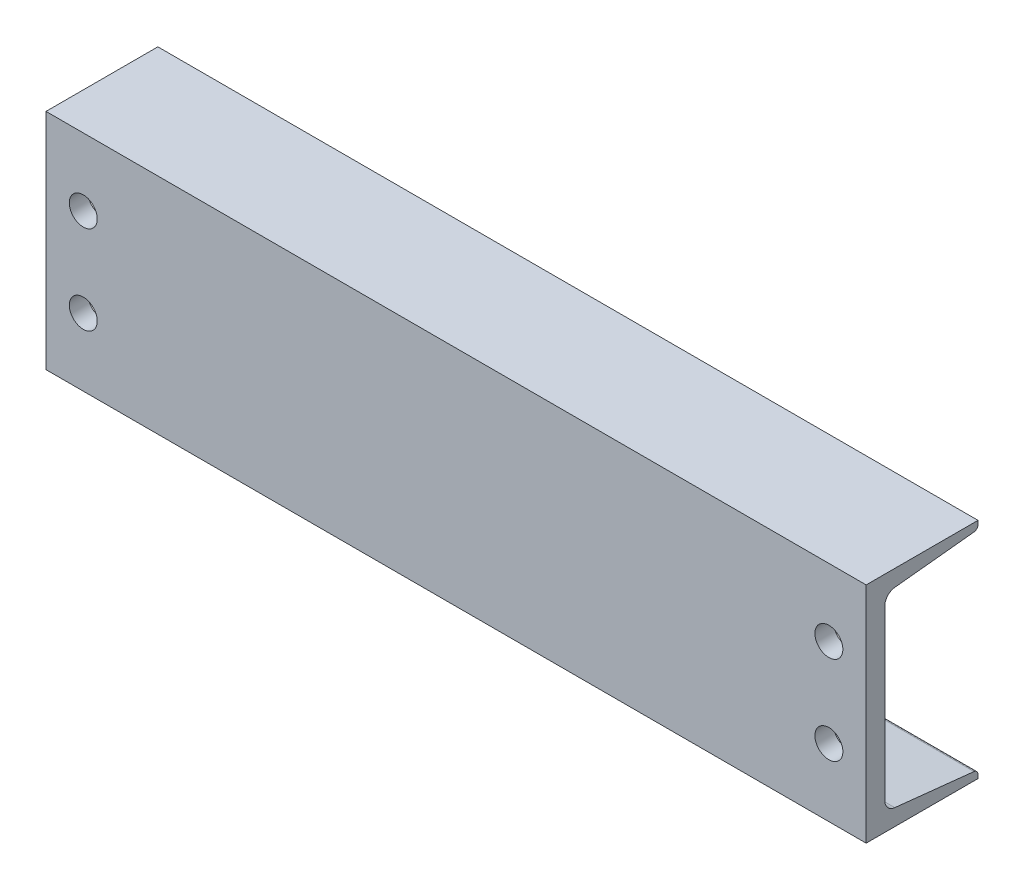
ISO-10303-21;
HEADER;
FILE_DESCRIPTION(('STEP AP214'),'2;1');
FILE_NAME('part.step','',(''),(''),'','','');
FILE_SCHEMA(('AUTOMOTIVE_DESIGN { 1 0 10303 214 1 1 1 1 }'));
ENDSEC;
DATA;
#1=APPLICATION_CONTEXT('core data for automotive mechanical design processes');
#2=APPLICATION_PROTOCOL_DEFINITION('international standard','automotive_design',2000,#1);
#3=PRODUCT_CONTEXT('',#1,'mechanical');
#4=PRODUCT('Part','Part','',(#3));
#5=PRODUCT_RELATED_PRODUCT_CATEGORY('part','',(#4));
#6=PRODUCT_DEFINITION_FORMATION('','',#4);
#7=PRODUCT_DEFINITION_CONTEXT('part definition',#1,'design');
#8=PRODUCT_DEFINITION('design','',#6,#7);
#9=PRODUCT_DEFINITION_SHAPE('','',#8);
#10=(LENGTH_UNIT() NAMED_UNIT(*) SI_UNIT(.MILLI.,.METRE.));
#11=(NAMED_UNIT(*) PLANE_ANGLE_UNIT() SI_UNIT($,.RADIAN.));
#12=(NAMED_UNIT(*) SI_UNIT($,.STERADIAN.) SOLID_ANGLE_UNIT());
#13=UNCERTAINTY_MEASURE_WITH_UNIT(LENGTH_MEASURE(1.E-05),#10,'distance_accuracy_value','');
#14=(GEOMETRIC_REPRESENTATION_CONTEXT(3) GLOBAL_UNCERTAINTY_ASSIGNED_CONTEXT((#13)) GLOBAL_UNIT_ASSIGNED_CONTEXT((#10,
#11,#12)) REPRESENTATION_CONTEXT('',''));
#15=CARTESIAN_POINT('',(0.,0.,0.));
#16=DIRECTION('',(0.,0.,1.));
#17=DIRECTION('',(1.,0.,0.));
#18=AXIS2_PLACEMENT_3D('',#15,#16,#17);
#19=CARTESIAN_POINT('',(279.4,-76.2,48.8061));
#20=DIRECTION('',(0.,1.,0.));
#21=DIRECTION('',(0.,0.,1.));
#22=AXIS2_PLACEMENT_3D('',#19,#20,#21);
#23=PLANE('',#22);
#24=CARTESIAN_POINT('',(165.1,-76.2,10.7061000000001));
#25=DIRECTION('',(0.,-1.,0.));
#26=DIRECTION('',(0.,0.,1.));
#27=AXIS2_PLACEMENT_3D('',#24,#25,#26);
#28=CIRCLE('',#27,9.525);
#29=CARTESIAN_POINT('',(165.1,-76.2,20.2311));
#30=VERTEX_POINT('',#29);
#31=EDGE_CURVE('E266',#30,#30,#28,.T.);
#32=ORIENTED_EDGE('',*,*,#31,.F.);
#33=EDGE_LOOP('',(#32));
#34=FACE_BOUND('',#33,.T.);
#35=CARTESIAN_POINT('',(-165.1,-76.2,10.7061));
#36=DIRECTION('',(0.,-1.,0.));
#37=DIRECTION('',(0.,0.,-1.));
#38=AXIS2_PLACEMENT_3D('',#35,#36,#37);
#39=CIRCLE('',#38,9.525);
#40=CARTESIAN_POINT('',(-165.1,-76.2,1.18110000000001));
#41=VERTEX_POINT('',#40);
#42=EDGE_CURVE('E269',#41,#41,#39,.T.);
#43=ORIENTED_EDGE('',*,*,#42,.F.);
#44=EDGE_LOOP('',(#43));
#45=FACE_BOUND('',#44,.T.);
#46=DIRECTION('',(0.,0.,-1.));
#47=VECTOR('',#46,1.);
#48=CARTESIAN_POINT('',(-279.4,-76.2,48.8061));
#49=LINE('',#48,#47);
#50=CARTESIAN_POINT('',(-279.4,-76.2,48.8061));
#51=VERTEX_POINT('',#50);
#52=CARTESIAN_POINT('',(-279.4,-76.2,-27.3939));
#53=VERTEX_POINT('',#52);
#54=EDGE_CURVE('E154',#51,#53,#49,.T.);
#55=ORIENTED_EDGE('',*,*,#54,.T.);
#56=DIRECTION('',(-1.,0.,0.));
#57=VECTOR('',#56,1.);
#58=CARTESIAN_POINT('',(279.4,-76.2,-27.3939));
#59=LINE('',#58,#57);
#60=CARTESIAN_POINT('',(279.4,-76.2,-27.3939));
#61=VERTEX_POINT('',#60);
#62=EDGE_CURVE('E11',#61,#53,#59,.T.);
#63=ORIENTED_EDGE('',*,*,#62,.F.);
#64=DIRECTION('',(0.,0.,-1.));
#65=VECTOR('',#64,1.);
#66=CARTESIAN_POINT('',(279.4,-76.2,48.8061));
#67=LINE('',#66,#65);
#68=CARTESIAN_POINT('',(279.4,-76.2,48.8061));
#69=VERTEX_POINT('',#68);
#70=EDGE_CURVE('E177',#69,#61,#67,.T.);
#71=ORIENTED_EDGE('',*,*,#70,.F.);
#72=DIRECTION('',(-1.,0.,0.));
#73=VECTOR('',#72,1.);
#74=CARTESIAN_POINT('',(279.4,-76.2,48.8061));
#75=LINE('',#74,#73);
#76=EDGE_CURVE('E150',#69,#51,#75,.T.);
#77=ORIENTED_EDGE('',*,*,#76,.T.);
#78=EDGE_LOOP('',(#55,#63,#71,#77));
#79=FACE_BOUND('',#78,.T.);
#80=ADVANCED_FACE('F34',(#34,#45,#79),#23,.F.);
#81=CARTESIAN_POINT('',(279.4,-76.2,-27.3939));
#82=DIRECTION('',(0.,0.,1.));
#83=DIRECTION('',(1.,0.,0.));
#84=AXIS2_PLACEMENT_3D('',#81,#82,#83);
#85=PLANE('',#84);
#86=DIRECTION('',(0.,1.,0.));
#87=VECTOR('',#86,1.);
#88=CARTESIAN_POINT('',(-279.4,-76.2,-27.3939));
#89=LINE('',#88,#87);
#90=CARTESIAN_POINT('',(-279.4,-73.7107446530364,-27.3939));
#91=VERTEX_POINT('',#90);
#92=EDGE_CURVE('E157',#53,#91,#89,.T.);
#93=ORIENTED_EDGE('',*,*,#92,.T.);
#94=DIRECTION('',(-1.,0.,0.));
#95=VECTOR('',#94,1.);
#96=CARTESIAN_POINT('',(279.4,-73.7107446530364,-27.3939));
#97=LINE('',#96,#95);
#98=CARTESIAN_POINT('',(279.4,-73.7107446530364,-27.3939));
#99=VERTEX_POINT('',#98);
#100=EDGE_CURVE('E42',#99,#91,#97,.T.);
#101=ORIENTED_EDGE('',*,*,#100,.F.);
#102=DIRECTION('',(0.,1.,0.));
#103=VECTOR('',#102,1.);
#104=CARTESIAN_POINT('',(279.4,-76.2,-27.3939));
#105=LINE('',#104,#103);
#106=EDGE_CURVE('E105',#61,#99,#105,.T.);
#107=ORIENTED_EDGE('',*,*,#106,.F.);
#108=ORIENTED_EDGE('',*,*,#62,.T.);
#109=EDGE_LOOP('',(#93,#101,#107,#108));
#110=FACE_BOUND('',#109,.T.);
#111=ADVANCED_FACE('F258',(#110),#85,.F.);
#112=CARTESIAN_POINT('',(279.4,-73.7107446530364,-24.3459));
#113=DIRECTION('',(-1.,0.,0.));
#114=DIRECTION('',(0.,0.,1.));
#115=AXIS2_PLACEMENT_3D('',#112,#113,#114);
#116=CYLINDRICAL_SURFACE('',#115,3.04799999999999);
#117=CARTESIAN_POINT('',(-279.4,-73.7107446530364,-24.3459));
#118=DIRECTION('',(1.,0.,0.));
#119=DIRECTION('',(0.,0.,-1.));
#120=AXIS2_PLACEMENT_3D('',#117,#118,#119);
#121=CIRCLE('',#120,3.04799999999999);
#122=CARTESIAN_POINT('',(-279.4,-70.6796721065635,-24.6666853145304));
#123=VERTEX_POINT('',#122);
#124=EDGE_CURVE('E160',#91,#123,#121,.T.);
#125=ORIENTED_EDGE('',*,*,#124,.T.);
#126=DIRECTION('',(-1.,0.,0.));
#127=VECTOR('',#126,1.);
#128=CARTESIAN_POINT('',(279.4,-70.6796721065635,-24.6666853145304));
#129=LINE('',#128,#127);
#130=CARTESIAN_POINT('',(279.4,-70.6796721065635,-24.6666853145304));
#131=VERTEX_POINT('',#130);
#132=EDGE_CURVE('E196',#131,#123,#129,.T.);
#133=ORIENTED_EDGE('',*,*,#132,.F.);
#134=CARTESIAN_POINT('',(279.4,-73.7107446530364,-24.3459));
#135=DIRECTION('',(1.,0.,0.));
#136=DIRECTION('',(0.,0.,-1.));
#137=AXIS2_PLACEMENT_3D('',#134,#135,#136);
#138=CIRCLE('',#137,3.04799999999999);
#139=EDGE_CURVE('E204',#99,#131,#138,.T.);
#140=ORIENTED_EDGE('',*,*,#139,.F.);
#141=ORIENTED_EDGE('',*,*,#100,.T.);
#142=EDGE_LOOP('',(#125,#133,#140,#141));
#143=FACE_BOUND('',#142,.T.);
#144=ADVANCED_FACE('F202',(#143),#116,.T.);
#145=CARTESIAN_POINT('',(279.4,-64.9695181148763,29.288063286326));
#146=DIRECTION('',(0.,-0.994446373514726,0.105244525764574));
#147=DIRECTION('',(0.,-0.105244525764574,-0.994446373514726));
#148=AXIS2_PLACEMENT_3D('',#145,#146,#147);
#149=PLANE('',#148);
#150=CARTESIAN_POINT('',(165.1,-66.9360896323852,10.7061000000001));
#151=DIRECTION('',(0.,-0.994446373514726,0.105244525764574));
#152=DIRECTION('',(0.,-0.105244525764574,-0.994446373514726));
#153=AXIS2_PLACEMENT_3D('',#150,#151,#152);
#154=ELLIPSE('',#153,9.57819371027044,9.525);
#155=CARTESIAN_POINT('',(165.1,-67.9441420871039,1.18110000000005));
#156=VERTEX_POINT('',#155);
#157=EDGE_CURVE('E272',#156,#156,#154,.F.);
#158=ORIENTED_EDGE('',*,*,#157,.F.);
#159=EDGE_LOOP('',(#158));
#160=FACE_BOUND('',#159,.T.);
#161=CARTESIAN_POINT('',(-165.1,-66.9360896323853,10.7061));
#162=DIRECTION('',(0.,-0.994446373514726,0.105244525764574));
#163=DIRECTION('',(0.,-0.105244525764574,-0.994446373514726));
#164=AXIS2_PLACEMENT_3D('',#161,#162,#163);
#165=ELLIPSE('',#164,9.57819371027044,9.525);
#166=CARTESIAN_POINT('',(-165.1,-67.9441420871039,1.18110000000001));
#167=VERTEX_POINT('',#166);
#168=EDGE_CURVE('E271',#167,#167,#165,.F.);
#169=ORIENTED_EDGE('',*,*,#168,.F.);
#170=EDGE_LOOP('',(#169));
#171=FACE_BOUND('',#170,.T.);
#172=DIRECTION('',(0.,0.105244525764574,0.994446373514726));
#173=VECTOR('',#172,1.);
#174=CARTESIAN_POINT('',(-279.4,-64.9695181148763,29.288063286326));
#175=LINE('',#174,#173);
#176=CARTESIAN_POINT('',(-279.4,-64.9695181148763,29.288063286326));
#177=VERTEX_POINT('',#176);
#178=EDGE_CURVE('E162',#123,#177,#175,.T.);
#179=ORIENTED_EDGE('',*,*,#178,.T.);
#180=DIRECTION('',(-1.,0.,0.));
#181=VECTOR('',#180,1.);
#182=CARTESIAN_POINT('',(279.4,-64.9695181148763,29.288063286326));
#183=LINE('',#182,#181);
#184=CARTESIAN_POINT('',(279.4,-64.9695181148763,29.288063286326));
#185=VERTEX_POINT('',#184);
#186=EDGE_CURVE('E193',#185,#177,#183,.T.);
#187=ORIENTED_EDGE('',*,*,#186,.F.);
#188=DIRECTION('',(0.,0.105244525764574,0.994446373514726));
#189=VECTOR('',#188,1.);
#190=CARTESIAN_POINT('',(279.4,-64.9695181148763,29.288063286326));
#191=LINE('',#190,#189);
#192=EDGE_CURVE('E222',#131,#185,#191,.T.);
#193=ORIENTED_EDGE('',*,*,#192,.F.);
#194=ORIENTED_EDGE('',*,*,#132,.T.);
#195=EDGE_LOOP('',(#179,#187,#193,#194));
#196=FACE_BOUND('',#195,.T.);
#197=ADVANCED_FACE('F213',(#160,#171,#196),#149,.F.);
#198=CARTESIAN_POINT('',(279.4,-57.3918367486941,28.4861));
#199=DIRECTION('',(-1.,0.,0.));
#200=DIRECTION('',(0.,0.,1.));
#201=AXIS2_PLACEMENT_3D('',#198,#199,#200);
#202=CYLINDRICAL_SURFACE('',#201,7.62000000000001);
#203=CARTESIAN_POINT('',(-279.4,-57.3918367486941,28.4861));
#204=DIRECTION('',(-1.,0.,0.));
#205=DIRECTION('',(0.,0.,-1.));
#206=AXIS2_PLACEMENT_3D('',#203,#204,#205);
#207=CIRCLE('',#206,7.62000000000001);
#208=CARTESIAN_POINT('',(-279.4,-57.3918367486941,36.1061));
#209=VERTEX_POINT('',#208);
#210=EDGE_CURVE('E164',#177,#209,#207,.T.);
#211=ORIENTED_EDGE('',*,*,#210,.T.);
#212=DIRECTION('',(-1.,0.,0.));
#213=VECTOR('',#212,1.);
#214=CARTESIAN_POINT('',(279.4,-57.3918367486941,36.1061));
#215=LINE('',#214,#213);
#216=CARTESIAN_POINT('',(279.4,-57.3918367486941,36.1061));
#217=VERTEX_POINT('',#216);
#218=EDGE_CURVE('E190',#217,#209,#215,.T.);
#219=ORIENTED_EDGE('',*,*,#218,.F.);
#220=CARTESIAN_POINT('',(279.4,-57.3918367486941,28.4861));
#221=DIRECTION('',(-1.,0.,0.));
#222=DIRECTION('',(0.,0.,-1.));
#223=AXIS2_PLACEMENT_3D('',#220,#221,#222);
#224=CIRCLE('',#223,7.62000000000001);
#225=EDGE_CURVE('E219',#185,#217,#224,.T.);
#226=ORIENTED_EDGE('',*,*,#225,.F.);
#227=ORIENTED_EDGE('',*,*,#186,.T.);
#228=EDGE_LOOP('',(#211,#219,#226,#227));
#229=FACE_BOUND('',#228,.T.);
#230=ADVANCED_FACE('F217',(#229),#202,.F.);
#231=CARTESIAN_POINT('',(279.4,57.3918367486941,36.1061));
#232=DIRECTION('',(0.,0.,1.));
#233=DIRECTION('',(0.,-1.,0.));
#234=AXIS2_PLACEMENT_3D('',#231,#232,#233);
#235=PLANE('',#234);
#236=CARTESIAN_POINT('',(254.,30.1625000000001,36.1061));
#237=DIRECTION('',(0.,0.,1.));
#238=DIRECTION('',(0.,-1.,0.));
#239=AXIS2_PLACEMENT_3D('',#236,#237,#238);
#240=CIRCLE('',#239,9.52500000000002);
#241=CARTESIAN_POINT('',(254.,20.6375000000001,36.1061));
#242=VERTEX_POINT('',#241);
#243=EDGE_CURVE('E283',#242,#242,#240,.F.);
#244=ORIENTED_EDGE('',*,*,#243,.F.);
#245=EDGE_LOOP('',(#244));
#246=FACE_BOUND('',#245,.T.);
#247=CARTESIAN_POINT('',(254.,-30.1625000000001,36.1061));
#248=DIRECTION('',(0.,0.,1.));
#249=DIRECTION('',(0.,-1.,0.));
#250=AXIS2_PLACEMENT_3D('',#247,#248,#249);
#251=CIRCLE('',#250,9.52500000000002);
#252=CARTESIAN_POINT('',(254.,-39.6875000000001,36.1061));
#253=VERTEX_POINT('',#252);
#254=EDGE_CURVE('E289',#253,#253,#251,.F.);
#255=ORIENTED_EDGE('',*,*,#254,.F.);
#256=EDGE_LOOP('',(#255));
#257=FACE_BOUND('',#256,.T.);
#258=CARTESIAN_POINT('',(-254.,-30.1625,36.1061));
#259=DIRECTION('',(0.,0.,1.));
#260=DIRECTION('',(0.,-1.,0.));
#261=AXIS2_PLACEMENT_3D('',#258,#259,#260);
#262=CIRCLE('',#261,9.52500000000002);
#263=CARTESIAN_POINT('',(-254.,-39.6875,36.1061));
#264=VERTEX_POINT('',#263);
#265=EDGE_CURVE('E295',#264,#264,#262,.F.);
#266=ORIENTED_EDGE('',*,*,#265,.F.);
#267=EDGE_LOOP('',(#266));
#268=FACE_BOUND('',#267,.T.);
#269=CARTESIAN_POINT('',(-254.,30.1625,36.1061));
#270=DIRECTION('',(0.,0.,1.));
#271=DIRECTION('',(0.,-1.,0.));
#272=AXIS2_PLACEMENT_3D('',#269,#270,#271);
#273=CIRCLE('',#272,9.52500000000002);
#274=CARTESIAN_POINT('',(-254.,20.6375,36.1061));
#275=VERTEX_POINT('',#274);
#276=EDGE_CURVE('E158',#275,#275,#273,.F.);
#277=ORIENTED_EDGE('',*,*,#276,.F.);
#278=EDGE_LOOP('',(#277));
#279=FACE_BOUND('',#278,.T.);
#280=DIRECTION('',(0.,1.,0.));
#281=VECTOR('',#280,1.);
#282=CARTESIAN_POINT('',(-279.4,57.3918367486941,36.1061));
#283=LINE('',#282,#281);
#284=CARTESIAN_POINT('',(-279.4,57.3918367486941,36.1061));
#285=VERTEX_POINT('',#284);
#286=EDGE_CURVE('E166',#209,#285,#283,.T.);
#287=ORIENTED_EDGE('',*,*,#286,.T.);
#288=DIRECTION('',(-1.,0.,0.));
#289=VECTOR('',#288,1.);
#290=CARTESIAN_POINT('',(279.4,57.3918367486941,36.1061));
#291=LINE('',#290,#289);
#292=CARTESIAN_POINT('',(279.4,57.3918367486941,36.1061));
#293=VERTEX_POINT('',#292);
#294=EDGE_CURVE('E187',#293,#285,#291,.T.);
#295=ORIENTED_EDGE('',*,*,#294,.F.);
#296=DIRECTION('',(0.,1.,0.));
#297=VECTOR('',#296,1.);
#298=CARTESIAN_POINT('',(279.4,57.3918367486941,36.1061));
#299=LINE('',#298,#297);
#300=EDGE_CURVE('E221',#217,#293,#299,.T.);
#301=ORIENTED_EDGE('',*,*,#300,.F.);
#302=ORIENTED_EDGE('',*,*,#218,.T.);
#303=EDGE_LOOP('',(#287,#295,#301,#302));
#304=FACE_BOUND('',#303,.T.);
#305=ADVANCED_FACE('F308',(#246,#257,#268,#279,#304),#235,.F.);
#306=CARTESIAN_POINT('',(279.4,57.3918367486941,28.4861));
#307=DIRECTION('',(-1.,0.,0.));
#308=DIRECTION('',(0.,0.,1.));
#309=AXIS2_PLACEMENT_3D('',#306,#307,#308);
#310=CYLINDRICAL_SURFACE('',#309,7.62000000000002);
#311=CARTESIAN_POINT('',(-279.4,57.3918367486941,28.4861));
#312=DIRECTION('',(-1.,0.,0.));
#313=DIRECTION('',(0.,0.,1.));
#314=AXIS2_PLACEMENT_3D('',#311,#312,#313);
#315=CIRCLE('',#314,7.62000000000002);
#316=CARTESIAN_POINT('',(-279.4,64.9695181148764,29.2880632863261));
#317=VERTEX_POINT('',#316);
#318=EDGE_CURVE('E168',#285,#317,#315,.T.);
#319=ORIENTED_EDGE('',*,*,#318,.T.);
#320=DIRECTION('',(-1.,0.,0.));
#321=VECTOR('',#320,1.);
#322=CARTESIAN_POINT('',(279.4,64.9695181148764,29.2880632863261));
#323=LINE('',#322,#321);
#324=CARTESIAN_POINT('',(279.4,64.9695181148764,29.2880632863261));
#325=VERTEX_POINT('',#324);
#326=EDGE_CURVE('E184',#325,#317,#323,.T.);
#327=ORIENTED_EDGE('',*,*,#326,.F.);
#328=CARTESIAN_POINT('',(279.4,57.3918367486941,28.4861));
#329=DIRECTION('',(-1.,0.,0.));
#330=DIRECTION('',(0.,0.,1.));
#331=AXIS2_PLACEMENT_3D('',#328,#329,#330);
#332=CIRCLE('',#331,7.62000000000002);
#333=EDGE_CURVE('E224',#293,#325,#332,.T.);
#334=ORIENTED_EDGE('',*,*,#333,.F.);
#335=ORIENTED_EDGE('',*,*,#294,.T.);
#336=EDGE_LOOP('',(#319,#327,#334,#335));
#337=FACE_BOUND('',#336,.T.);
#338=ADVANCED_FACE('F311',(#337),#310,.F.);
#339=CARTESIAN_POINT('',(279.4,64.9695181148764,29.2880632863261));
#340=DIRECTION('',(0.,0.994446373514726,0.105244525764573));
#341=DIRECTION('',(0.,-0.105244525764573,0.994446373514726));
#342=AXIS2_PLACEMENT_3D('',#339,#340,#341);
#343=PLANE('',#342);
#344=DIRECTION('',(0.,0.105244525764573,-0.994446373514726));
#345=VECTOR('',#344,1.);
#346=CARTESIAN_POINT('',(-279.4,64.9695181148764,29.2880632863261));
#347=LINE('',#346,#345);
#348=CARTESIAN_POINT('',(-279.4,70.6796721065635,-24.6666853145304));
#349=VERTEX_POINT('',#348);
#350=EDGE_CURVE('E170',#317,#349,#347,.T.);
#351=ORIENTED_EDGE('',*,*,#350,.T.);
#352=DIRECTION('',(-1.,0.,0.));
#353=VECTOR('',#352,1.);
#354=CARTESIAN_POINT('',(279.4,70.6796721065635,-24.6666853145304));
#355=LINE('',#354,#353);
#356=CARTESIAN_POINT('',(279.4,70.6796721065635,-24.6666853145304));
#357=VERTEX_POINT('',#356);
#358=EDGE_CURVE('E181',#357,#349,#355,.T.);
#359=ORIENTED_EDGE('',*,*,#358,.F.);
#360=DIRECTION('',(0.,0.105244525764573,-0.994446373514726));
#361=VECTOR('',#360,1.);
#362=CARTESIAN_POINT('',(279.4,64.9695181148764,29.2880632863261));
#363=LINE('',#362,#361);
#364=EDGE_CURVE('E230',#325,#357,#363,.T.);
#365=ORIENTED_EDGE('',*,*,#364,.F.);
#366=ORIENTED_EDGE('',*,*,#326,.T.);
#367=EDGE_LOOP('',(#351,#359,#365,#366));
#368=FACE_BOUND('',#367,.T.);
#369=ADVANCED_FACE('F236',(#368),#343,.F.);
#370=CARTESIAN_POINT('',(279.4,73.7107446530364,-24.3459));
#371=DIRECTION('',(-1.,0.,0.));
#372=DIRECTION('',(0.,0.,1.));
#373=AXIS2_PLACEMENT_3D('',#370,#371,#372);
#374=CYLINDRICAL_SURFACE('',#373,3.048);
#375=CARTESIAN_POINT('',(-279.4,73.7107446530364,-24.3459));
#376=DIRECTION('',(1.,0.,0.));
#377=DIRECTION('',(0.,0.,1.));
#378=AXIS2_PLACEMENT_3D('',#375,#376,#377);
#379=CIRCLE('',#378,3.048);
#380=CARTESIAN_POINT('',(-279.4,73.7107446530364,-27.3939));
#381=VERTEX_POINT('',#380);
#382=EDGE_CURVE('E172',#349,#381,#379,.T.);
#383=ORIENTED_EDGE('',*,*,#382,.T.);
#384=DIRECTION('',(-1.,0.,0.));
#385=VECTOR('',#384,1.);
#386=CARTESIAN_POINT('',(279.4,73.7107446530364,-27.3939));
#387=LINE('',#386,#385);
#388=CARTESIAN_POINT('',(279.4,73.7107446530364,-27.3939));
#389=VERTEX_POINT('',#388);
#390=EDGE_CURVE('E145',#389,#381,#387,.T.);
#391=ORIENTED_EDGE('',*,*,#390,.F.);
#392=CARTESIAN_POINT('',(279.4,73.7107446530364,-24.3459));
#393=DIRECTION('',(1.,0.,0.));
#394=DIRECTION('',(0.,0.,1.));
#395=AXIS2_PLACEMENT_3D('',#392,#393,#394);
#396=CIRCLE('',#395,3.048);
#397=EDGE_CURVE('E136',#357,#389,#396,.T.);
#398=ORIENTED_EDGE('',*,*,#397,.F.);
#399=ORIENTED_EDGE('',*,*,#358,.T.);
#400=EDGE_LOOP('',(#383,#391,#398,#399));
#401=FACE_BOUND('',#400,.T.);
#402=ADVANCED_FACE('F240',(#401),#374,.T.);
#403=CARTESIAN_POINT('',(279.4,76.2,-27.3939));
#404=DIRECTION('',(0.,0.,1.));
#405=DIRECTION('',(0.,-1.,0.));
#406=AXIS2_PLACEMENT_3D('',#403,#404,#405);
#407=PLANE('',#406);
#408=DIRECTION('',(0.,1.,0.));
#409=VECTOR('',#408,1.);
#410=CARTESIAN_POINT('',(-279.4,76.2,-27.3939));
#411=LINE('',#410,#409);
#412=CARTESIAN_POINT('',(-279.4,76.2,-27.3939));
#413=VERTEX_POINT('',#412);
#414=EDGE_CURVE('E144',#381,#413,#411,.T.);
#415=ORIENTED_EDGE('',*,*,#414,.T.);
#416=DIRECTION('',(-1.,0.,0.));
#417=VECTOR('',#416,1.);
#418=CARTESIAN_POINT('',(279.4,76.2,-27.3939));
#419=LINE('',#418,#417);
#420=CARTESIAN_POINT('',(279.4,76.2,-27.3939));
#421=VERTEX_POINT('',#420);
#422=EDGE_CURVE('E141',#421,#413,#419,.T.);
#423=ORIENTED_EDGE('',*,*,#422,.F.);
#424=DIRECTION('',(0.,1.,0.));
#425=VECTOR('',#424,1.);
#426=CARTESIAN_POINT('',(279.4,76.2,-27.3939));
#427=LINE('',#426,#425);
#428=EDGE_CURVE('E130',#389,#421,#427,.T.);
#429=ORIENTED_EDGE('',*,*,#428,.F.);
#430=ORIENTED_EDGE('',*,*,#390,.T.);
#431=EDGE_LOOP('',(#415,#423,#429,#430));
#432=FACE_BOUND('',#431,.T.);
#433=ADVANCED_FACE('F142',(#432),#407,.F.);
#434=CARTESIAN_POINT('',(279.4,76.2,48.8061));
#435=DIRECTION('',(0.,-1.,0.));
#436=DIRECTION('',(0.,0.,-1.));
#437=AXIS2_PLACEMENT_3D('',#434,#435,#436);
#438=PLANE('',#437);
#439=DIRECTION('',(0.,0.,1.));
#440=VECTOR('',#439,1.);
#441=CARTESIAN_POINT('',(-279.4,76.2,48.8061));
#442=LINE('',#441,#440);
#443=CARTESIAN_POINT('',(-279.4,76.2,48.8061));
#444=VERTEX_POINT('',#443);
#445=EDGE_CURVE('E91',#413,#444,#442,.T.);
#446=ORIENTED_EDGE('',*,*,#445,.T.);
#447=DIRECTION('',(-1.,0.,0.));
#448=VECTOR('',#447,1.);
#449=CARTESIAN_POINT('',(279.4,76.2,48.8061));
#450=LINE('',#449,#448);
#451=CARTESIAN_POINT('',(279.4,76.2,48.8061));
#452=VERTEX_POINT('',#451);
#453=EDGE_CURVE('E146',#452,#444,#450,.T.);
#454=ORIENTED_EDGE('',*,*,#453,.F.);
#455=DIRECTION('',(0.,0.,1.));
#456=VECTOR('',#455,1.);
#457=CARTESIAN_POINT('',(279.4,76.2,48.8061));
#458=LINE('',#457,#456);
#459=EDGE_CURVE('E134',#421,#452,#458,.T.);
#460=ORIENTED_EDGE('',*,*,#459,.F.);
#461=ORIENTED_EDGE('',*,*,#422,.T.);
#462=EDGE_LOOP('',(#446,#454,#460,#461));
#463=FACE_BOUND('',#462,.T.);
#464=ADVANCED_FACE('F148',(#463),#438,.F.);
#465=CARTESIAN_POINT('',(279.4,-76.2,48.8061));
#466=DIRECTION('',(0.,0.,-1.));
#467=DIRECTION('',(-1.,0.,0.));
#468=AXIS2_PLACEMENT_3D('',#465,#466,#467);
#469=PLANE('',#468);
#470=CARTESIAN_POINT('',(254.,30.1625000000001,48.8061));
#471=DIRECTION('',(0.,0.,1.));
#472=DIRECTION('',(-1.,0.,0.));
#473=AXIS2_PLACEMENT_3D('',#470,#471,#472);
#474=CIRCLE('',#473,9.52500000000002);
#475=CARTESIAN_POINT('',(244.475,30.1625000000001,48.8061));
#476=VERTEX_POINT('',#475);
#477=EDGE_CURVE('E275',#476,#476,#474,.T.);
#478=ORIENTED_EDGE('',*,*,#477,.F.);
#479=EDGE_LOOP('',(#478));
#480=FACE_BOUND('',#479,.T.);
#481=CARTESIAN_POINT('',(254.,-30.1625000000001,48.8061));
#482=DIRECTION('',(0.,0.,1.));
#483=DIRECTION('',(1.,0.,0.));
#484=AXIS2_PLACEMENT_3D('',#481,#482,#483);
#485=CIRCLE('',#484,9.52500000000002);
#486=CARTESIAN_POINT('',(263.525,-30.1625000000001,48.8061));
#487=VERTEX_POINT('',#486);
#488=EDGE_CURVE('E286',#487,#487,#485,.T.);
#489=ORIENTED_EDGE('',*,*,#488,.F.);
#490=EDGE_LOOP('',(#489));
#491=FACE_BOUND('',#490,.T.);
#492=CARTESIAN_POINT('',(-254.,-30.1625,48.8061));
#493=DIRECTION('',(0.,0.,1.));
#494=DIRECTION('',(-1.,0.,0.));
#495=AXIS2_PLACEMENT_3D('',#492,#493,#494);
#496=CIRCLE('',#495,9.52500000000002);
#497=CARTESIAN_POINT('',(-263.525,-30.1625,48.8061));
#498=VERTEX_POINT('',#497);
#499=EDGE_CURVE('E292',#498,#498,#496,.T.);
#500=ORIENTED_EDGE('',*,*,#499,.F.);
#501=EDGE_LOOP('',(#500));
#502=FACE_BOUND('',#501,.T.);
#503=CARTESIAN_POINT('',(-254.,30.1625,48.8061));
#504=DIRECTION('',(0.,0.,1.));
#505=DIRECTION('',(1.,0.,0.));
#506=AXIS2_PLACEMENT_3D('',#503,#504,#505);
#507=CIRCLE('',#506,9.52500000000002);
#508=CARTESIAN_POINT('',(-244.475,30.1625,48.8061));
#509=VERTEX_POINT('',#508);
#510=EDGE_CURVE('E298',#509,#509,#507,.T.);
#511=ORIENTED_EDGE('',*,*,#510,.F.);
#512=EDGE_LOOP('',(#511));
#513=FACE_BOUND('',#512,.T.);
#514=DIRECTION('',(0.,-1.,0.));
#515=VECTOR('',#514,1.);
#516=CARTESIAN_POINT('',(-279.4,-76.2,48.8061));
#517=LINE('',#516,#515);
#518=EDGE_CURVE('E97',#444,#51,#517,.T.);
#519=ORIENTED_EDGE('',*,*,#518,.T.);
#520=ORIENTED_EDGE('',*,*,#76,.F.);
#521=DIRECTION('',(0.,-1.,0.));
#522=VECTOR('',#521,1.);
#523=CARTESIAN_POINT('',(279.4,-76.2,48.8061));
#524=LINE('',#523,#522);
#525=EDGE_CURVE('E50',#452,#69,#524,.T.);
#526=ORIENTED_EDGE('',*,*,#525,.F.);
#527=ORIENTED_EDGE('',*,*,#453,.T.);
#528=EDGE_LOOP('',(#519,#520,#526,#527));
#529=FACE_BOUND('',#528,.T.);
#530=ADVANCED_FACE('F244',(#480,#491,#502,#513,#529),#469,.F.);
#531=CARTESIAN_POINT('',(279.4,-73.7107446530364,-24.3459));
#532=DIRECTION('',(1.,0.,0.));
#533=DIRECTION('',(0.,0.,-1.));
#534=AXIS2_PLACEMENT_3D('',#531,#532,#533);
#535=PLANE('',#534);
#536=ORIENTED_EDGE('',*,*,#70,.T.);
#537=ORIENTED_EDGE('',*,*,#106,.T.);
#538=ORIENTED_EDGE('',*,*,#139,.T.);
#539=ORIENTED_EDGE('',*,*,#192,.T.);
#540=ORIENTED_EDGE('',*,*,#225,.T.);
#541=ORIENTED_EDGE('',*,*,#300,.T.);
#542=ORIENTED_EDGE('',*,*,#333,.T.);
#543=ORIENTED_EDGE('',*,*,#364,.T.);
#544=ORIENTED_EDGE('',*,*,#397,.T.);
#545=ORIENTED_EDGE('',*,*,#428,.T.);
#546=ORIENTED_EDGE('',*,*,#459,.T.);
#547=ORIENTED_EDGE('',*,*,#525,.T.);
#548=EDGE_LOOP('',(#536,#537,#538,#539,#540,#541,#542,#543,#544,#545,#546,#547));
#549=FACE_BOUND('',#548,.T.);
#550=ADVANCED_FACE('F132',(#549),#535,.T.);
#551=CARTESIAN_POINT('',(-279.4,-73.7107446530364,-24.3459));
#552=DIRECTION('',(1.,0.,0.));
#553=DIRECTION('',(0.,0.,-1.));
#554=AXIS2_PLACEMENT_3D('',#551,#552,#553);
#555=PLANE('',#554);
#556=ORIENTED_EDGE('',*,*,#54,.F.);
#557=ORIENTED_EDGE('',*,*,#518,.F.);
#558=ORIENTED_EDGE('',*,*,#445,.F.);
#559=ORIENTED_EDGE('',*,*,#414,.F.);
#560=ORIENTED_EDGE('',*,*,#382,.F.);
#561=ORIENTED_EDGE('',*,*,#350,.F.);
#562=ORIENTED_EDGE('',*,*,#318,.F.);
#563=ORIENTED_EDGE('',*,*,#286,.F.);
#564=ORIENTED_EDGE('',*,*,#210,.F.);
#565=ORIENTED_EDGE('',*,*,#178,.F.);
#566=ORIENTED_EDGE('',*,*,#124,.F.);
#567=ORIENTED_EDGE('',*,*,#92,.F.);
#568=EDGE_LOOP('',(#556,#557,#558,#559,#560,#561,#562,#563,#564,#565,#566,#567));
#569=FACE_BOUND('',#568,.T.);
#570=ADVANCED_FACE('F208',(#569),#555,.F.);
#571=CARTESIAN_POINT('',(-254.,30.1625,-27.3949));
#572=DIRECTION('',(0.,0.,1.));
#573=DIRECTION('',(1.,0.,0.));
#574=AXIS2_PLACEMENT_3D('',#571,#572,#573);
#575=CYLINDRICAL_SURFACE('',#574,9.52500000000002);
#576=ORIENTED_EDGE('',*,*,#510,.T.);
#577=EDGE_LOOP('',(#576));
#578=FACE_BOUND('',#577,.T.);
#579=ORIENTED_EDGE('',*,*,#276,.T.);
#580=EDGE_LOOP('',(#579));
#581=FACE_BOUND('',#580,.T.);
#582=ADVANCED_FACE('F306',(#578,#581),#575,.F.);
#583=CARTESIAN_POINT('',(-254.,-30.1625,-27.3949));
#584=DIRECTION('',(0.,0.,1.));
#585=DIRECTION('',(1.,0.,0.));
#586=AXIS2_PLACEMENT_3D('',#583,#584,#585);
#587=CYLINDRICAL_SURFACE('',#586,9.52500000000002);
#588=ORIENTED_EDGE('',*,*,#499,.T.);
#589=EDGE_LOOP('',(#588));
#590=FACE_BOUND('',#589,.T.);
#591=ORIENTED_EDGE('',*,*,#265,.T.);
#592=EDGE_LOOP('',(#591));
#593=FACE_BOUND('',#592,.T.);
#594=ADVANCED_FACE('F369',(#590,#593),#587,.F.);
#595=CARTESIAN_POINT('',(254.,-30.1625000000001,-27.3949));
#596=DIRECTION('',(0.,0.,1.));
#597=DIRECTION('',(1.,0.,0.));
#598=AXIS2_PLACEMENT_3D('',#595,#596,#597);
#599=CYLINDRICAL_SURFACE('',#598,9.52500000000002);
#600=ORIENTED_EDGE('',*,*,#488,.T.);
#601=EDGE_LOOP('',(#600));
#602=FACE_BOUND('',#601,.T.);
#603=ORIENTED_EDGE('',*,*,#254,.T.);
#604=EDGE_LOOP('',(#603));
#605=FACE_BOUND('',#604,.T.);
#606=ADVANCED_FACE('F379',(#602,#605),#599,.F.);
#607=CARTESIAN_POINT('',(254.,30.1625000000001,-27.3949));
#608=DIRECTION('',(0.,0.,1.));
#609=DIRECTION('',(1.,0.,0.));
#610=AXIS2_PLACEMENT_3D('',#607,#608,#609);
#611=CYLINDRICAL_SURFACE('',#610,9.52500000000002);
#612=ORIENTED_EDGE('',*,*,#477,.T.);
#613=EDGE_LOOP('',(#612));
#614=FACE_BOUND('',#613,.T.);
#615=ORIENTED_EDGE('',*,*,#243,.T.);
#616=EDGE_LOOP('',(#615));
#617=FACE_BOUND('',#616,.T.);
#618=ADVANCED_FACE('F389',(#614,#617),#611,.F.);
#619=CARTESIAN_POINT('',(-165.1,76.201,10.7061));
#620=DIRECTION('',(0.,-1.,0.));
#621=DIRECTION('',(0.,0.,-1.));
#622=AXIS2_PLACEMENT_3D('',#619,#620,#621);
#623=CYLINDRICAL_SURFACE('',#622,9.525);
#624=ORIENTED_EDGE('',*,*,#42,.T.);
#625=EDGE_LOOP('',(#624));
#626=FACE_BOUND('',#625,.T.);
#627=ORIENTED_EDGE('',*,*,#168,.T.);
#628=EDGE_LOOP('',(#627));
#629=FACE_BOUND('',#628,.T.);
#630=ADVANCED_FACE('F398',(#626,#629),#623,.F.);
#631=CARTESIAN_POINT('',(165.1,76.201,10.7061000000001));
#632=DIRECTION('',(0.,-1.,0.));
#633=DIRECTION('',(0.,0.,-1.));
#634=AXIS2_PLACEMENT_3D('',#631,#632,#633);
#635=CYLINDRICAL_SURFACE('',#634,9.525);
#636=ORIENTED_EDGE('',*,*,#31,.T.);
#637=EDGE_LOOP('',(#636));
#638=FACE_BOUND('',#637,.T.);
#639=ORIENTED_EDGE('',*,*,#157,.T.);
#640=EDGE_LOOP('',(#639));
#641=FACE_BOUND('',#640,.T.);
#642=ADVANCED_FACE('F422',(#638,#641),#635,.F.);
#643=CLOSED_SHELL('',(#80,#111,#144,#197,#230,#305,#338,#369,#402,#433,#464,#530,#550,#570,#582,
#594,#606,#618,#630,#642));
#644=MANIFOLD_SOLID_BREP('B2',#643);
#645=ADVANCED_BREP_SHAPE_REPRESENTATION('',(#18,#644),#14);
#646=SHAPE_DEFINITION_REPRESENTATION(#9,#645);
ENDSEC;
END-ISO-10303-21;
